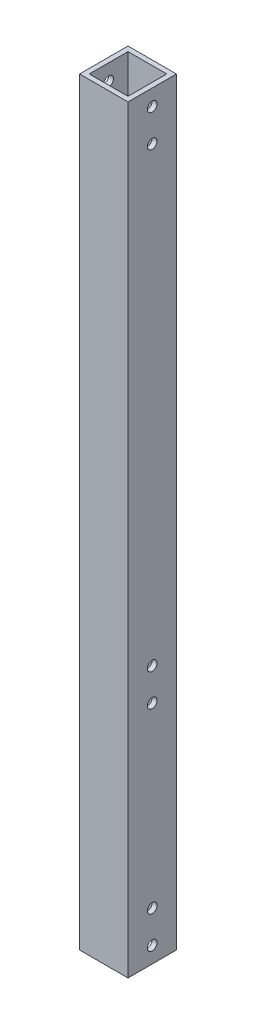
ISO-10303-21;
HEADER;
FILE_DESCRIPTION(('STEP AP214'),'2;1');
FILE_NAME('part.step','',(''),(''),'','','');
FILE_SCHEMA(('AUTOMOTIVE_DESIGN { 1 0 10303 214 1 1 1 1 }'));
ENDSEC;
DATA;
#1=APPLICATION_CONTEXT('core data for automotive mechanical design processes');
#2=APPLICATION_PROTOCOL_DEFINITION('international standard','automotive_design',2000,#1);
#3=PRODUCT_CONTEXT('',#1,'mechanical');
#4=PRODUCT('Part','Part','',(#3));
#5=PRODUCT_RELATED_PRODUCT_CATEGORY('part','',(#4));
#6=PRODUCT_DEFINITION_FORMATION('','',#4);
#7=PRODUCT_DEFINITION_CONTEXT('part definition',#1,'design');
#8=PRODUCT_DEFINITION('design','',#6,#7);
#9=PRODUCT_DEFINITION_SHAPE('','',#8);
#10=(LENGTH_UNIT() NAMED_UNIT(*) SI_UNIT(.MILLI.,.METRE.));
#11=(NAMED_UNIT(*) PLANE_ANGLE_UNIT() SI_UNIT($,.RADIAN.));
#12=(NAMED_UNIT(*) SI_UNIT($,.STERADIAN.) SOLID_ANGLE_UNIT());
#13=UNCERTAINTY_MEASURE_WITH_UNIT(LENGTH_MEASURE(1.E-05),#10,'distance_accuracy_value','');
#14=(GEOMETRIC_REPRESENTATION_CONTEXT(3) GLOBAL_UNCERTAINTY_ASSIGNED_CONTEXT((#13)) GLOBAL_UNIT_ASSIGNED_CONTEXT((#10,
#11,#12)) REPRESENTATION_CONTEXT('',''));
#15=CARTESIAN_POINT('',(0.,0.,0.));
#16=DIRECTION('',(0.,0.,1.));
#17=DIRECTION('',(1.,0.,0.));
#18=AXIS2_PLACEMENT_3D('',#15,#16,#17);
#19=CARTESIAN_POINT('',(0.,235.,0.));
#20=DIRECTION('',(0.,1.,0.));
#21=DIRECTION('',(0.,0.,1.));
#22=AXIS2_PLACEMENT_3D('',#19,#20,#21);
#23=PLANE('',#22);
#24=DIRECTION('',(0.,0.,1.));
#25=VECTOR('',#24,1.);
#26=CARTESIAN_POINT('',(0.,235.,0.));
#27=LINE('',#26,#25);
#28=CARTESIAN_POINT('',(0.,235.,-15.));
#29=VERTEX_POINT('',#28);
#30=CARTESIAN_POINT('',(0.,235.,0.));
#31=VERTEX_POINT('',#30);
#32=EDGE_CURVE('E186',#29,#31,#27,.T.);
#33=ORIENTED_EDGE('',*,*,#32,.T.);
#34=DIRECTION('',(1.,0.,0.));
#35=VECTOR('',#34,1.);
#36=CARTESIAN_POINT('',(0.,235.,0.));
#37=LINE('',#36,#35);
#38=CARTESIAN_POINT('',(15.,235.,0.));
#39=VERTEX_POINT('',#38);
#40=EDGE_CURVE('E190',#31,#39,#37,.T.);
#41=ORIENTED_EDGE('',*,*,#40,.T.);
#42=DIRECTION('',(0.,0.,-1.));
#43=VECTOR('',#42,1.);
#44=CARTESIAN_POINT('',(15.,235.,0.));
#45=LINE('',#44,#43);
#46=CARTESIAN_POINT('',(15.,235.,-15.));
#47=VERTEX_POINT('',#46);
#48=EDGE_CURVE('E194',#39,#47,#45,.T.);
#49=ORIENTED_EDGE('',*,*,#48,.T.);
#50=DIRECTION('',(-1.,0.,0.));
#51=VECTOR('',#50,1.);
#52=CARTESIAN_POINT('',(0.,235.,-15.));
#53=LINE('',#52,#51);
#54=EDGE_CURVE('E197',#47,#29,#53,.T.);
#55=ORIENTED_EDGE('',*,*,#54,.T.);
#56=EDGE_LOOP('',(#33,#41,#49,#55));
#57=FACE_BOUND('',#56,.T.);
#58=DIRECTION('',(1.,0.,0.));
#59=VECTOR('',#58,1.);
#60=CARTESIAN_POINT('',(0.,235.,-1.5));
#61=LINE('',#60,#59);
#62=CARTESIAN_POINT('',(1.5,235.,-1.5));
#63=VERTEX_POINT('',#62);
#64=CARTESIAN_POINT('',(13.5,235.,-1.5));
#65=VERTEX_POINT('',#64);
#66=EDGE_CURVE('E145',#63,#65,#61,.T.);
#67=ORIENTED_EDGE('',*,*,#66,.F.);
#68=DIRECTION('',(0.,0.,1.));
#69=VECTOR('',#68,1.);
#70=CARTESIAN_POINT('',(1.5,235.,0.));
#71=LINE('',#70,#69);
#72=CARTESIAN_POINT('',(1.5,235.,-13.5));
#73=VERTEX_POINT('',#72);
#74=EDGE_CURVE('E136',#73,#63,#71,.T.);
#75=ORIENTED_EDGE('',*,*,#74,.F.);
#76=DIRECTION('',(-1.,0.,0.));
#77=VECTOR('',#76,1.);
#78=CARTESIAN_POINT('',(0.,235.,-13.5));
#79=LINE('',#78,#77);
#80=CARTESIAN_POINT('',(13.5,235.,-13.5));
#81=VERTEX_POINT('',#80);
#82=EDGE_CURVE('E162',#81,#73,#79,.T.);
#83=ORIENTED_EDGE('',*,*,#82,.F.);
#84=DIRECTION('',(0.,0.,-1.));
#85=VECTOR('',#84,1.);
#86=CARTESIAN_POINT('',(13.5,235.,0.));
#87=LINE('',#86,#85);
#88=EDGE_CURVE('E158',#65,#81,#87,.T.);
#89=ORIENTED_EDGE('',*,*,#88,.F.);
#90=EDGE_LOOP('',(#67,#75,#83,#89));
#91=FACE_BOUND('',#90,.T.);
#92=ADVANCED_FACE('F68',(#57,#91),#23,.T.);
#93=CARTESIAN_POINT('',(0.,0.,0.));
#94=DIRECTION('',(0.,1.,0.));
#95=DIRECTION('',(0.,0.,1.));
#96=AXIS2_PLACEMENT_3D('',#93,#94,#95);
#97=PLANE('',#96);
#98=DIRECTION('',(0.,0.,1.));
#99=VECTOR('',#98,1.);
#100=CARTESIAN_POINT('',(0.,0.,0.));
#101=LINE('',#100,#99);
#102=CARTESIAN_POINT('',(0.,0.,-15.));
#103=VERTEX_POINT('',#102);
#104=CARTESIAN_POINT('',(0.,0.,0.));
#105=VERTEX_POINT('',#104);
#106=EDGE_CURVE('E154',#103,#105,#101,.T.);
#107=ORIENTED_EDGE('',*,*,#106,.F.);
#108=DIRECTION('',(-1.,0.,0.));
#109=VECTOR('',#108,1.);
#110=CARTESIAN_POINT('',(0.,0.,-15.));
#111=LINE('',#110,#109);
#112=CARTESIAN_POINT('',(15.,0.,-15.));
#113=VERTEX_POINT('',#112);
#114=EDGE_CURVE('E191',#113,#103,#111,.T.);
#115=ORIENTED_EDGE('',*,*,#114,.F.);
#116=DIRECTION('',(0.,0.,-1.));
#117=VECTOR('',#116,1.);
#118=CARTESIAN_POINT('',(15.,0.,0.));
#119=LINE('',#118,#117);
#120=CARTESIAN_POINT('',(15.,0.,0.));
#121=VERTEX_POINT('',#120);
#122=EDGE_CURVE('E207',#121,#113,#119,.T.);
#123=ORIENTED_EDGE('',*,*,#122,.F.);
#124=DIRECTION('',(1.,0.,0.));
#125=VECTOR('',#124,1.);
#126=CARTESIAN_POINT('',(0.,0.,0.));
#127=LINE('',#126,#125);
#128=EDGE_CURVE('E204',#105,#121,#127,.T.);
#129=ORIENTED_EDGE('',*,*,#128,.F.);
#130=EDGE_LOOP('',(#107,#115,#123,#129));
#131=FACE_BOUND('',#130,.T.);
#132=DIRECTION('',(0.,0.,1.));
#133=VECTOR('',#132,1.);
#134=CARTESIAN_POINT('',(1.5,0.,0.));
#135=LINE('',#134,#133);
#136=CARTESIAN_POINT('',(1.5,0.,-13.5));
#137=VERTEX_POINT('',#136);
#138=CARTESIAN_POINT('',(1.5,0.,-1.5));
#139=VERTEX_POINT('',#138);
#140=EDGE_CURVE('E94',#137,#139,#135,.T.);
#141=ORIENTED_EDGE('',*,*,#140,.T.);
#142=DIRECTION('',(1.,0.,0.));
#143=VECTOR('',#142,1.);
#144=CARTESIAN_POINT('',(0.,0.,-1.5));
#145=LINE('',#144,#143);
#146=CARTESIAN_POINT('',(13.5,0.,-1.5));
#147=VERTEX_POINT('',#146);
#148=EDGE_CURVE('E152',#139,#147,#145,.T.);
#149=ORIENTED_EDGE('',*,*,#148,.T.);
#150=DIRECTION('',(0.,0.,-1.));
#151=VECTOR('',#150,1.);
#152=CARTESIAN_POINT('',(13.5,0.,0.));
#153=LINE('',#152,#151);
#154=CARTESIAN_POINT('',(13.5,0.,-13.5));
#155=VERTEX_POINT('',#154);
#156=EDGE_CURVE('E173',#147,#155,#153,.T.);
#157=ORIENTED_EDGE('',*,*,#156,.T.);
#158=DIRECTION('',(-1.,0.,0.));
#159=VECTOR('',#158,1.);
#160=CARTESIAN_POINT('',(0.,0.,-13.5));
#161=LINE('',#160,#159);
#162=EDGE_CURVE('E146',#155,#137,#161,.T.);
#163=ORIENTED_EDGE('',*,*,#162,.T.);
#164=EDGE_LOOP('',(#141,#149,#157,#163));
#165=FACE_BOUND('',#164,.T.);
#166=ADVANCED_FACE('F342',(#131,#165),#97,.F.);
#167=CARTESIAN_POINT('',(0.,235.,0.));
#168=DIRECTION('',(1.,0.,0.));
#169=DIRECTION('',(0.,0.,-1.));
#170=AXIS2_PLACEMENT_3D('',#167,#168,#169);
#171=PLANE('',#170);
#172=CARTESIAN_POINT('',(0.,79.9999999999943,-7.5));
#173=DIRECTION('',(1.,0.,0.));
#174=DIRECTION('',(0.,0.,-1.));
#175=AXIS2_PLACEMENT_3D('',#172,#173,#174);
#176=CIRCLE('',#175,1.5);
#177=CARTESIAN_POINT('',(0.,79.9999999999943,-9.));
#178=VERTEX_POINT('',#177);
#179=EDGE_CURVE('E245',#178,#178,#176,.T.);
#180=ORIENTED_EDGE('',*,*,#179,.T.);
#181=EDGE_LOOP('',(#180));
#182=FACE_BOUND('',#181,.T.);
#183=CARTESIAN_POINT('',(0.,69.9999999999943,-7.5));
#184=DIRECTION('',(1.,0.,0.));
#185=DIRECTION('',(0.,0.,-1.));
#186=AXIS2_PLACEMENT_3D('',#183,#184,#185);
#187=CIRCLE('',#186,1.5);
#188=CARTESIAN_POINT('',(0.,69.9999999999943,-9.));
#189=VERTEX_POINT('',#188);
#190=EDGE_CURVE('E265',#189,#189,#187,.T.);
#191=ORIENTED_EDGE('',*,*,#190,.T.);
#192=EDGE_LOOP('',(#191));
#193=FACE_BOUND('',#192,.T.);
#194=CARTESIAN_POINT('',(0.,230.,-7.50000000000001));
#195=DIRECTION('',(1.,0.,0.));
#196=DIRECTION('',(0.,0.,-1.));
#197=AXIS2_PLACEMENT_3D('',#194,#195,#196);
#198=CIRCLE('',#197,1.5);
#199=CARTESIAN_POINT('',(0.,230.,-9.00000000000001));
#200=VERTEX_POINT('',#199);
#201=EDGE_CURVE('E273',#200,#200,#198,.T.);
#202=ORIENTED_EDGE('',*,*,#201,.T.);
#203=EDGE_LOOP('',(#202));
#204=FACE_BOUND('',#203,.T.);
#205=CARTESIAN_POINT('',(0.,220.,-7.50000000000001));
#206=DIRECTION('',(1.,0.,0.));
#207=DIRECTION('',(0.,0.,-1.));
#208=AXIS2_PLACEMENT_3D('',#205,#206,#207);
#209=CIRCLE('',#208,1.5);
#210=CARTESIAN_POINT('',(0.,220.,-9.00000000000001));
#211=VERTEX_POINT('',#210);
#212=EDGE_CURVE('E287',#211,#211,#209,.T.);
#213=ORIENTED_EDGE('',*,*,#212,.T.);
#214=EDGE_LOOP('',(#213));
#215=FACE_BOUND('',#214,.T.);
#216=CARTESIAN_POINT('',(0.,5.,-7.5));
#217=DIRECTION('',(1.,0.,0.));
#218=DIRECTION('',(0.,0.,-1.));
#219=AXIS2_PLACEMENT_3D('',#216,#217,#218);
#220=CIRCLE('',#219,1.5);
#221=CARTESIAN_POINT('',(0.,5.,-9.));
#222=VERTEX_POINT('',#221);
#223=EDGE_CURVE('E279',#222,#222,#220,.T.);
#224=ORIENTED_EDGE('',*,*,#223,.T.);
#225=EDGE_LOOP('',(#224));
#226=FACE_BOUND('',#225,.T.);
#227=CARTESIAN_POINT('',(0.,15.,-7.5));
#228=DIRECTION('',(1.,0.,0.));
#229=DIRECTION('',(0.,0.,-1.));
#230=AXIS2_PLACEMENT_3D('',#227,#228,#229);
#231=CIRCLE('',#230,1.5);
#232=CARTESIAN_POINT('',(0.,15.,-9.));
#233=VERTEX_POINT('',#232);
#234=EDGE_CURVE('E227',#233,#233,#231,.T.);
#235=ORIENTED_EDGE('',*,*,#234,.T.);
#236=EDGE_LOOP('',(#235));
#237=FACE_BOUND('',#236,.T.);
#238=ORIENTED_EDGE('',*,*,#106,.T.);
#239=DIRECTION('',(0.,-1.,0.));
#240=VECTOR('',#239,1.);
#241=CARTESIAN_POINT('',(0.,235.,0.));
#242=LINE('',#241,#240);
#243=EDGE_CURVE('E12',#31,#105,#242,.T.);
#244=ORIENTED_EDGE('',*,*,#243,.F.);
#245=ORIENTED_EDGE('',*,*,#32,.F.);
#246=DIRECTION('',(0.,-1.,0.));
#247=VECTOR('',#246,1.);
#248=CARTESIAN_POINT('',(0.,235.,-15.));
#249=LINE('',#248,#247);
#250=EDGE_CURVE('E200',#29,#103,#249,.T.);
#251=ORIENTED_EDGE('',*,*,#250,.T.);
#252=EDGE_LOOP('',(#238,#244,#245,#251));
#253=FACE_BOUND('',#252,.T.);
#254=ADVANCED_FACE('F70',(#182,#193,#204,#215,#226,#237,#253),#171,.F.);
#255=CARTESIAN_POINT('',(0.,235.,0.));
#256=DIRECTION('',(0.,0.,-1.));
#257=DIRECTION('',(-1.,0.,0.));
#258=AXIS2_PLACEMENT_3D('',#255,#256,#257);
#259=PLANE('',#258);
#260=ORIENTED_EDGE('',*,*,#128,.T.);
#261=DIRECTION('',(0.,-1.,0.));
#262=VECTOR('',#261,1.);
#263=CARTESIAN_POINT('',(15.,235.,0.));
#264=LINE('',#263,#262);
#265=EDGE_CURVE('E78',#39,#121,#264,.T.);
#266=ORIENTED_EDGE('',*,*,#265,.F.);
#267=ORIENTED_EDGE('',*,*,#40,.F.);
#268=ORIENTED_EDGE('',*,*,#243,.T.);
#269=EDGE_LOOP('',(#260,#266,#267,#268));
#270=FACE_BOUND('',#269,.T.);
#271=ADVANCED_FACE('F341',(#270),#259,.F.);
#272=CARTESIAN_POINT('',(15.,235.,0.));
#273=DIRECTION('',(-1.,0.,0.));
#274=DIRECTION('',(0.,0.,1.));
#275=AXIS2_PLACEMENT_3D('',#272,#273,#274);
#276=PLANE('',#275);
#277=CARTESIAN_POINT('',(15.,79.9999999999943,-7.5));
#278=DIRECTION('',(1.,0.,0.));
#279=DIRECTION('',(0.,0.,-1.));
#280=AXIS2_PLACEMENT_3D('',#277,#278,#279);
#281=CIRCLE('',#280,1.5);
#282=CARTESIAN_POINT('',(15.,79.9999999999943,-9.));
#283=VERTEX_POINT('',#282);
#284=EDGE_CURVE('E253',#283,#283,#281,.T.);
#285=ORIENTED_EDGE('',*,*,#284,.F.);
#286=EDGE_LOOP('',(#285));
#287=FACE_BOUND('',#286,.T.);
#288=CARTESIAN_POINT('',(15.,69.9999999999943,-7.5));
#289=DIRECTION('',(1.,0.,0.));
#290=DIRECTION('',(0.,0.,-1.));
#291=AXIS2_PLACEMENT_3D('',#288,#289,#290);
#292=CIRCLE('',#291,1.5);
#293=CARTESIAN_POINT('',(15.,69.9999999999943,-9.));
#294=VERTEX_POINT('',#293);
#295=EDGE_CURVE('E259',#294,#294,#292,.T.);
#296=ORIENTED_EDGE('',*,*,#295,.F.);
#297=EDGE_LOOP('',(#296));
#298=FACE_BOUND('',#297,.T.);
#299=CARTESIAN_POINT('',(15.,230.,-7.50000000000001));
#300=DIRECTION('',(1.,0.,0.));
#301=DIRECTION('',(0.,0.,-1.));
#302=AXIS2_PLACEMENT_3D('',#299,#300,#301);
#303=CIRCLE('',#302,1.5);
#304=CARTESIAN_POINT('',(15.,230.,-9.00000000000001));
#305=VERTEX_POINT('',#304);
#306=EDGE_CURVE('E291',#305,#305,#303,.T.);
#307=ORIENTED_EDGE('',*,*,#306,.F.);
#308=EDGE_LOOP('',(#307));
#309=FACE_BOUND('',#308,.T.);
#310=CARTESIAN_POINT('',(15.,220.,-7.50000000000001));
#311=DIRECTION('',(1.,0.,0.));
#312=DIRECTION('',(0.,0.,-1.));
#313=AXIS2_PLACEMENT_3D('',#310,#311,#312);
#314=CIRCLE('',#313,1.5);
#315=CARTESIAN_POINT('',(15.,220.,-9.00000000000001));
#316=VERTEX_POINT('',#315);
#317=EDGE_CURVE('E283',#316,#316,#314,.T.);
#318=ORIENTED_EDGE('',*,*,#317,.F.);
#319=EDGE_LOOP('',(#318));
#320=FACE_BOUND('',#319,.T.);
#321=CARTESIAN_POINT('',(15.,5.,-7.5));
#322=DIRECTION('',(1.,0.,0.));
#323=DIRECTION('',(0.,0.,-1.));
#324=AXIS2_PLACEMENT_3D('',#321,#322,#323);
#325=CIRCLE('',#324,1.5);
#326=CARTESIAN_POINT('',(15.,5.,-9.));
#327=VERTEX_POINT('',#326);
#328=EDGE_CURVE('E274',#327,#327,#325,.T.);
#329=ORIENTED_EDGE('',*,*,#328,.F.);
#330=EDGE_LOOP('',(#329));
#331=FACE_BOUND('',#330,.T.);
#332=CARTESIAN_POINT('',(15.,15.,-7.5));
#333=DIRECTION('',(1.,0.,0.));
#334=DIRECTION('',(0.,0.,-1.));
#335=AXIS2_PLACEMENT_3D('',#332,#333,#334);
#336=CIRCLE('',#335,1.5);
#337=CARTESIAN_POINT('',(15.,15.,-9.));
#338=VERTEX_POINT('',#337);
#339=EDGE_CURVE('E278',#338,#338,#336,.T.);
#340=ORIENTED_EDGE('',*,*,#339,.F.);
#341=EDGE_LOOP('',(#340));
#342=FACE_BOUND('',#341,.T.);
#343=ORIENTED_EDGE('',*,*,#122,.T.);
#344=DIRECTION('',(0.,-1.,0.));
#345=VECTOR('',#344,1.);
#346=CARTESIAN_POINT('',(15.,235.,-15.));
#347=LINE('',#346,#345);
#348=EDGE_CURVE('E215',#47,#113,#347,.T.);
#349=ORIENTED_EDGE('',*,*,#348,.F.);
#350=ORIENTED_EDGE('',*,*,#48,.F.);
#351=ORIENTED_EDGE('',*,*,#265,.T.);
#352=EDGE_LOOP('',(#343,#349,#350,#351));
#353=FACE_BOUND('',#352,.T.);
#354=ADVANCED_FACE('F359',(#287,#298,#309,#320,#331,#342,#353),#276,.F.);
#355=CARTESIAN_POINT('',(0.,235.,-15.));
#356=DIRECTION('',(0.,0.,1.));
#357=DIRECTION('',(1.,0.,0.));
#358=AXIS2_PLACEMENT_3D('',#355,#356,#357);
#359=PLANE('',#358);
#360=ORIENTED_EDGE('',*,*,#114,.T.);
#361=ORIENTED_EDGE('',*,*,#250,.F.);
#362=ORIENTED_EDGE('',*,*,#54,.F.);
#363=ORIENTED_EDGE('',*,*,#348,.T.);
#364=EDGE_LOOP('',(#360,#361,#362,#363));
#365=FACE_BOUND('',#364,.T.);
#366=ADVANCED_FACE('F321',(#365),#359,.F.);
#367=CARTESIAN_POINT('',(1.5,235.,0.));
#368=DIRECTION('',(1.,0.,0.));
#369=DIRECTION('',(0.,0.,-1.));
#370=AXIS2_PLACEMENT_3D('',#367,#368,#369);
#371=PLANE('',#370);
#372=CARTESIAN_POINT('',(1.5,79.9999999999943,-7.5));
#373=DIRECTION('',(1.,0.,0.));
#374=DIRECTION('',(0.,0.,-1.));
#375=AXIS2_PLACEMENT_3D('',#372,#373,#374);
#376=CIRCLE('',#375,1.5);
#377=CARTESIAN_POINT('',(1.5,79.9999999999943,-9.));
#378=VERTEX_POINT('',#377);
#379=EDGE_CURVE('E269',#378,#378,#376,.T.);
#380=ORIENTED_EDGE('',*,*,#379,.F.);
#381=EDGE_LOOP('',(#380));
#382=FACE_BOUND('',#381,.T.);
#383=CARTESIAN_POINT('',(1.5,69.9999999999943,-7.5));
#384=DIRECTION('',(1.,0.,0.));
#385=DIRECTION('',(0.,0.,-1.));
#386=AXIS2_PLACEMENT_3D('',#383,#384,#385);
#387=CIRCLE('',#386,1.5);
#388=CARTESIAN_POINT('',(1.5,69.9999999999943,-9.));
#389=VERTEX_POINT('',#388);
#390=EDGE_CURVE('E244',#389,#389,#387,.T.);
#391=ORIENTED_EDGE('',*,*,#390,.F.);
#392=EDGE_LOOP('',(#391));
#393=FACE_BOUND('',#392,.T.);
#394=CARTESIAN_POINT('',(1.5,230.,-7.50000000000001));
#395=DIRECTION('',(1.,0.,0.));
#396=DIRECTION('',(0.,0.,-1.));
#397=AXIS2_PLACEMENT_3D('',#394,#395,#396);
#398=CIRCLE('',#397,1.5);
#399=CARTESIAN_POINT('',(1.5,230.,-9.00000000000001));
#400=VERTEX_POINT('',#399);
#401=EDGE_CURVE('E170',#400,#400,#398,.T.);
#402=ORIENTED_EDGE('',*,*,#401,.F.);
#403=EDGE_LOOP('',(#402));
#404=FACE_BOUND('',#403,.T.);
#405=CARTESIAN_POINT('',(1.5,220.,-7.50000000000001));
#406=DIRECTION('',(1.,0.,0.));
#407=DIRECTION('',(0.,0.,-1.));
#408=AXIS2_PLACEMENT_3D('',#405,#406,#407);
#409=CIRCLE('',#408,1.5);
#410=CARTESIAN_POINT('',(1.5,220.,-9.00000000000001));
#411=VERTEX_POINT('',#410);
#412=EDGE_CURVE('E237',#411,#411,#409,.T.);
#413=ORIENTED_EDGE('',*,*,#412,.F.);
#414=EDGE_LOOP('',(#413));
#415=FACE_BOUND('',#414,.T.);
#416=CARTESIAN_POINT('',(1.5,5.,-7.5));
#417=DIRECTION('',(1.,0.,0.));
#418=DIRECTION('',(0.,0.,-1.));
#419=AXIS2_PLACEMENT_3D('',#416,#417,#418);
#420=CIRCLE('',#419,1.5);
#421=CARTESIAN_POINT('',(1.5,5.,-9.));
#422=VERTEX_POINT('',#421);
#423=EDGE_CURVE('E232',#422,#422,#420,.T.);
#424=ORIENTED_EDGE('',*,*,#423,.F.);
#425=EDGE_LOOP('',(#424));
#426=FACE_BOUND('',#425,.T.);
#427=CARTESIAN_POINT('',(1.5,15.,-7.5));
#428=DIRECTION('',(1.,0.,0.));
#429=DIRECTION('',(0.,0.,-1.));
#430=AXIS2_PLACEMENT_3D('',#427,#428,#429);
#431=CIRCLE('',#430,1.5);
#432=CARTESIAN_POINT('',(1.5,15.,-9.));
#433=VERTEX_POINT('',#432);
#434=EDGE_CURVE('E226',#433,#433,#431,.T.);
#435=ORIENTED_EDGE('',*,*,#434,.F.);
#436=EDGE_LOOP('',(#435));
#437=FACE_BOUND('',#436,.T.);
#438=ORIENTED_EDGE('',*,*,#140,.F.);
#439=DIRECTION('',(0.,-1.,0.));
#440=VECTOR('',#439,1.);
#441=CARTESIAN_POINT('',(1.5,235.,-13.5));
#442=LINE('',#441,#440);
#443=EDGE_CURVE('E140',#73,#137,#442,.T.);
#444=ORIENTED_EDGE('',*,*,#443,.F.);
#445=ORIENTED_EDGE('',*,*,#74,.T.);
#446=DIRECTION('',(0.,-1.,0.));
#447=VECTOR('',#446,1.);
#448=CARTESIAN_POINT('',(1.5,235.,-1.5));
#449=LINE('',#448,#447);
#450=EDGE_CURVE('E139',#63,#139,#449,.T.);
#451=ORIENTED_EDGE('',*,*,#450,.T.);
#452=EDGE_LOOP('',(#438,#444,#445,#451));
#453=FACE_BOUND('',#452,.T.);
#454=ADVANCED_FACE('F138',(#382,#393,#404,#415,#426,#437,#453),#371,.T.);
#455=CARTESIAN_POINT('',(0.,235.,-1.5));
#456=DIRECTION('',(0.,0.,-1.));
#457=DIRECTION('',(-1.,0.,0.));
#458=AXIS2_PLACEMENT_3D('',#455,#456,#457);
#459=PLANE('',#458);
#460=ORIENTED_EDGE('',*,*,#148,.F.);
#461=ORIENTED_EDGE('',*,*,#450,.F.);
#462=ORIENTED_EDGE('',*,*,#66,.T.);
#463=DIRECTION('',(0.,-1.,0.));
#464=VECTOR('',#463,1.);
#465=CARTESIAN_POINT('',(13.5,235.,-1.5));
#466=LINE('',#465,#464);
#467=EDGE_CURVE('E155',#65,#147,#466,.T.);
#468=ORIENTED_EDGE('',*,*,#467,.T.);
#469=EDGE_LOOP('',(#460,#461,#462,#468));
#470=FACE_BOUND('',#469,.T.);
#471=ADVANCED_FACE('F149',(#470),#459,.T.);
#472=CARTESIAN_POINT('',(13.5,235.,0.));
#473=DIRECTION('',(-1.,0.,0.));
#474=DIRECTION('',(0.,0.,1.));
#475=AXIS2_PLACEMENT_3D('',#472,#473,#474);
#476=PLANE('',#475);
#477=CARTESIAN_POINT('',(13.5,79.9999999999943,-7.5));
#478=DIRECTION('',(-1.,0.,0.));
#479=DIRECTION('',(0.,0.,1.));
#480=AXIS2_PLACEMENT_3D('',#477,#478,#479);
#481=CIRCLE('',#480,1.5);
#482=CARTESIAN_POINT('',(13.5,79.9999999999943,-6.));
#483=VERTEX_POINT('',#482);
#484=EDGE_CURVE('E72',#483,#483,#481,.T.);
#485=ORIENTED_EDGE('',*,*,#484,.F.);
#486=EDGE_LOOP('',(#485));
#487=FACE_BOUND('',#486,.T.);
#488=CARTESIAN_POINT('',(13.5,69.9999999999943,-7.5));
#489=DIRECTION('',(-1.,0.,0.));
#490=DIRECTION('',(0.,0.,1.));
#491=AXIS2_PLACEMENT_3D('',#488,#489,#490);
#492=CIRCLE('',#491,1.5);
#493=CARTESIAN_POINT('',(13.5,69.9999999999943,-6.));
#494=VERTEX_POINT('',#493);
#495=EDGE_CURVE('E241',#494,#494,#492,.T.);
#496=ORIENTED_EDGE('',*,*,#495,.F.);
#497=EDGE_LOOP('',(#496));
#498=FACE_BOUND('',#497,.T.);
#499=CARTESIAN_POINT('',(13.5,230.,-7.50000000000001));
#500=DIRECTION('',(-1.,0.,0.));
#501=DIRECTION('',(0.,0.,1.));
#502=AXIS2_PLACEMENT_3D('',#499,#500,#501);
#503=CIRCLE('',#502,1.5);
#504=CARTESIAN_POINT('',(13.5,230.,-6.));
#505=VERTEX_POINT('',#504);
#506=EDGE_CURVE('E238',#505,#505,#503,.T.);
#507=ORIENTED_EDGE('',*,*,#506,.F.);
#508=EDGE_LOOP('',(#507));
#509=FACE_BOUND('',#508,.T.);
#510=CARTESIAN_POINT('',(13.5,220.,-7.50000000000001));
#511=DIRECTION('',(-1.,0.,0.));
#512=DIRECTION('',(0.,0.,1.));
#513=AXIS2_PLACEMENT_3D('',#510,#511,#512);
#514=CIRCLE('',#513,1.5);
#515=CARTESIAN_POINT('',(13.5,220.,-6.00000000000001));
#516=VERTEX_POINT('',#515);
#517=EDGE_CURVE('E233',#516,#516,#514,.T.);
#518=ORIENTED_EDGE('',*,*,#517,.F.);
#519=EDGE_LOOP('',(#518));
#520=FACE_BOUND('',#519,.T.);
#521=CARTESIAN_POINT('',(13.5,5.,-7.5));
#522=DIRECTION('',(-1.,0.,0.));
#523=DIRECTION('',(0.,0.,1.));
#524=AXIS2_PLACEMENT_3D('',#521,#522,#523);
#525=CIRCLE('',#524,1.5);
#526=CARTESIAN_POINT('',(13.5,5.,-6.));
#527=VERTEX_POINT('',#526);
#528=EDGE_CURVE('E228',#527,#527,#525,.T.);
#529=ORIENTED_EDGE('',*,*,#528,.F.);
#530=EDGE_LOOP('',(#529));
#531=FACE_BOUND('',#530,.T.);
#532=CARTESIAN_POINT('',(13.5,15.,-7.5));
#533=DIRECTION('',(-1.,0.,0.));
#534=DIRECTION('',(0.,0.,1.));
#535=AXIS2_PLACEMENT_3D('',#532,#533,#534);
#536=CIRCLE('',#535,1.5);
#537=CARTESIAN_POINT('',(13.5,15.,-6.));
#538=VERTEX_POINT('',#537);
#539=EDGE_CURVE('E222',#538,#538,#536,.T.);
#540=ORIENTED_EDGE('',*,*,#539,.F.);
#541=EDGE_LOOP('',(#540));
#542=FACE_BOUND('',#541,.T.);
#543=ORIENTED_EDGE('',*,*,#156,.F.);
#544=ORIENTED_EDGE('',*,*,#467,.F.);
#545=ORIENTED_EDGE('',*,*,#88,.T.);
#546=DIRECTION('',(0.,-1.,0.));
#547=VECTOR('',#546,1.);
#548=CARTESIAN_POINT('',(13.5,235.,-13.5));
#549=LINE('',#548,#547);
#550=EDGE_CURVE('E86',#81,#155,#549,.T.);
#551=ORIENTED_EDGE('',*,*,#550,.T.);
#552=EDGE_LOOP('',(#543,#544,#545,#551));
#553=FACE_BOUND('',#552,.T.);
#554=ADVANCED_FACE('F379',(#487,#498,#509,#520,#531,#542,#553),#476,.T.);
#555=CARTESIAN_POINT('',(0.,235.,-13.5));
#556=DIRECTION('',(0.,0.,1.));
#557=DIRECTION('',(1.,0.,0.));
#558=AXIS2_PLACEMENT_3D('',#555,#556,#557);
#559=PLANE('',#558);
#560=ORIENTED_EDGE('',*,*,#162,.F.);
#561=ORIENTED_EDGE('',*,*,#550,.F.);
#562=ORIENTED_EDGE('',*,*,#82,.T.);
#563=ORIENTED_EDGE('',*,*,#443,.T.);
#564=EDGE_LOOP('',(#560,#561,#562,#563));
#565=FACE_BOUND('',#564,.T.);
#566=ADVANCED_FACE('F382',(#565),#559,.T.);
#567=CARTESIAN_POINT('',(0.,15.,-7.5));
#568=DIRECTION('',(1.,0.,0.));
#569=DIRECTION('',(0.,0.,-1.));
#570=AXIS2_PLACEMENT_3D('',#567,#568,#569);
#571=CYLINDRICAL_SURFACE('',#570,1.5);
#572=ORIENTED_EDGE('',*,*,#539,.T.);
#573=EDGE_LOOP('',(#572));
#574=FACE_BOUND('',#573,.T.);
#575=ORIENTED_EDGE('',*,*,#339,.T.);
#576=EDGE_LOOP('',(#575));
#577=FACE_BOUND('',#576,.T.);
#578=ADVANCED_FACE('F336',(#574,#577),#571,.F.);
#579=CARTESIAN_POINT('',(0.,5.,-7.5));
#580=DIRECTION('',(1.,0.,0.));
#581=DIRECTION('',(0.,0.,-1.));
#582=AXIS2_PLACEMENT_3D('',#579,#580,#581);
#583=CYLINDRICAL_SURFACE('',#582,1.5);
#584=ORIENTED_EDGE('',*,*,#528,.T.);
#585=EDGE_LOOP('',(#584));
#586=FACE_BOUND('',#585,.T.);
#587=ORIENTED_EDGE('',*,*,#328,.T.);
#588=EDGE_LOOP('',(#587));
#589=FACE_BOUND('',#588,.T.);
#590=ADVANCED_FACE('F387',(#586,#589),#583,.F.);
#591=CARTESIAN_POINT('',(0.,220.,-7.50000000000001));
#592=DIRECTION('',(1.,0.,0.));
#593=DIRECTION('',(0.,0.,-1.));
#594=AXIS2_PLACEMENT_3D('',#591,#592,#593);
#595=CYLINDRICAL_SURFACE('',#594,1.5);
#596=ORIENTED_EDGE('',*,*,#517,.T.);
#597=EDGE_LOOP('',(#596));
#598=FACE_BOUND('',#597,.T.);
#599=ORIENTED_EDGE('',*,*,#317,.T.);
#600=EDGE_LOOP('',(#599));
#601=FACE_BOUND('',#600,.T.);
#602=ADVANCED_FACE('F391',(#598,#601),#595,.F.);
#603=CARTESIAN_POINT('',(0.,230.,-7.50000000000001));
#604=DIRECTION('',(1.,0.,0.));
#605=DIRECTION('',(0.,0.,-1.));
#606=AXIS2_PLACEMENT_3D('',#603,#604,#605);
#607=CYLINDRICAL_SURFACE('',#606,1.5);
#608=ORIENTED_EDGE('',*,*,#506,.T.);
#609=EDGE_LOOP('',(#608));
#610=FACE_BOUND('',#609,.T.);
#611=ORIENTED_EDGE('',*,*,#306,.T.);
#612=EDGE_LOOP('',(#611));
#613=FACE_BOUND('',#612,.T.);
#614=ADVANCED_FACE('F334',(#610,#613),#607,.F.);
#615=ORIENTED_EDGE('',*,*,#434,.T.);
#616=EDGE_LOOP('',(#615));
#617=FACE_BOUND('',#616,.T.);
#618=ORIENTED_EDGE('',*,*,#234,.F.);
#619=EDGE_LOOP('',(#618));
#620=FACE_BOUND('',#619,.T.);
#621=ADVANCED_FACE('F330',(#617,#620),#571,.F.);
#622=ORIENTED_EDGE('',*,*,#423,.T.);
#623=EDGE_LOOP('',(#622));
#624=FACE_BOUND('',#623,.T.);
#625=ORIENTED_EDGE('',*,*,#223,.F.);
#626=EDGE_LOOP('',(#625));
#627=FACE_BOUND('',#626,.T.);
#628=ADVANCED_FACE('F333',(#624,#627),#583,.F.);
#629=ORIENTED_EDGE('',*,*,#412,.T.);
#630=EDGE_LOOP('',(#629));
#631=FACE_BOUND('',#630,.T.);
#632=ORIENTED_EDGE('',*,*,#212,.F.);
#633=EDGE_LOOP('',(#632));
#634=FACE_BOUND('',#633,.T.);
#635=ADVANCED_FACE('F396',(#631,#634),#595,.F.);
#636=ORIENTED_EDGE('',*,*,#401,.T.);
#637=EDGE_LOOP('',(#636));
#638=FACE_BOUND('',#637,.T.);
#639=ORIENTED_EDGE('',*,*,#201,.F.);
#640=EDGE_LOOP('',(#639));
#641=FACE_BOUND('',#640,.T.);
#642=ADVANCED_FACE('F316',(#638,#641),#607,.F.);
#643=CARTESIAN_POINT('',(0.,69.9999999999943,-7.5));
#644=DIRECTION('',(1.,0.,0.));
#645=DIRECTION('',(0.,0.,-1.));
#646=AXIS2_PLACEMENT_3D('',#643,#644,#645);
#647=CYLINDRICAL_SURFACE('',#646,1.5);
#648=ORIENTED_EDGE('',*,*,#495,.T.);
#649=EDGE_LOOP('',(#648));
#650=FACE_BOUND('',#649,.T.);
#651=ORIENTED_EDGE('',*,*,#295,.T.);
#652=EDGE_LOOP('',(#651));
#653=FACE_BOUND('',#652,.T.);
#654=ADVANCED_FACE('F400',(#650,#653),#647,.F.);
#655=CARTESIAN_POINT('',(0.,79.9999999999943,-7.5));
#656=DIRECTION('',(1.,0.,0.));
#657=DIRECTION('',(0.,0.,-1.));
#658=AXIS2_PLACEMENT_3D('',#655,#656,#657);
#659=CYLINDRICAL_SURFACE('',#658,1.5);
#660=ORIENTED_EDGE('',*,*,#484,.T.);
#661=EDGE_LOOP('',(#660));
#662=FACE_BOUND('',#661,.T.);
#663=ORIENTED_EDGE('',*,*,#284,.T.);
#664=EDGE_LOOP('',(#663));
#665=FACE_BOUND('',#664,.T.);
#666=ADVANCED_FACE('F403',(#662,#665),#659,.F.);
#667=ORIENTED_EDGE('',*,*,#390,.T.);
#668=EDGE_LOOP('',(#667));
#669=FACE_BOUND('',#668,.T.);
#670=ORIENTED_EDGE('',*,*,#190,.F.);
#671=EDGE_LOOP('',(#670));
#672=FACE_BOUND('',#671,.T.);
#673=ADVANCED_FACE('F404',(#669,#672),#647,.F.);
#674=ORIENTED_EDGE('',*,*,#379,.T.);
#675=EDGE_LOOP('',(#674));
#676=FACE_BOUND('',#675,.T.);
#677=ORIENTED_EDGE('',*,*,#179,.F.);
#678=EDGE_LOOP('',(#677));
#679=FACE_BOUND('',#678,.T.);
#680=ADVANCED_FACE('F407',(#676,#679),#659,.F.);
#681=CLOSED_SHELL('',(#92,#166,#254,#271,#354,#366,#454,#471,#554,#566,#578,#590,#602,#614,#621,
#628,#635,#642,#654,#666,#673,#680));
#682=MANIFOLD_SOLID_BREP('B2',#681);
#683=ADVANCED_BREP_SHAPE_REPRESENTATION('',(#18,#682),#14);
#684=SHAPE_DEFINITION_REPRESENTATION(#9,#683);
ENDSEC;
END-ISO-10303-21;
